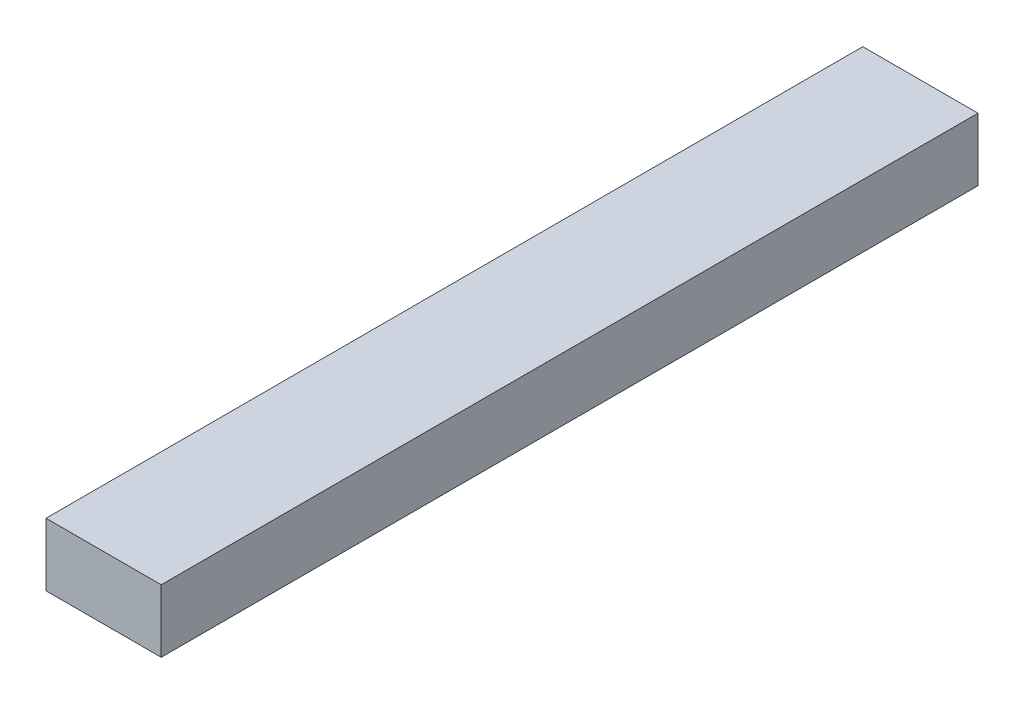
ISO-10303-21;
HEADER;
FILE_DESCRIPTION(('STEP AP214'),'2;1');
FILE_NAME('part.step','',(''),(''),'','','');
FILE_SCHEMA(('AUTOMOTIVE_DESIGN { 1 0 10303 214 1 1 1 1 }'));
ENDSEC;
DATA;
#1=APPLICATION_CONTEXT('core data for automotive mechanical design processes');
#2=APPLICATION_PROTOCOL_DEFINITION('international standard','automotive_design',2000,#1);
#3=PRODUCT_CONTEXT('',#1,'mechanical');
#4=PRODUCT('Part','Part','',(#3));
#5=PRODUCT_RELATED_PRODUCT_CATEGORY('part','',(#4));
#6=PRODUCT_DEFINITION_FORMATION('','',#4);
#7=PRODUCT_DEFINITION_CONTEXT('part definition',#1,'design');
#8=PRODUCT_DEFINITION('design','',#6,#7);
#9=PRODUCT_DEFINITION_SHAPE('','',#8);
#10=(LENGTH_UNIT() NAMED_UNIT(*) SI_UNIT(.MILLI.,.METRE.));
#11=(NAMED_UNIT(*) PLANE_ANGLE_UNIT() SI_UNIT($,.RADIAN.));
#12=(NAMED_UNIT(*) SI_UNIT($,.STERADIAN.) SOLID_ANGLE_UNIT());
#13=UNCERTAINTY_MEASURE_WITH_UNIT(LENGTH_MEASURE(1.E-05),#10,'distance_accuracy_value','');
#14=(GEOMETRIC_REPRESENTATION_CONTEXT(3) GLOBAL_UNCERTAINTY_ASSIGNED_CONTEXT((#13)) GLOBAL_UNIT_ASSIGNED_CONTEXT((#10,
#11,#12)) REPRESENTATION_CONTEXT('',''));
#15=CARTESIAN_POINT('',(0.,0.,0.));
#16=DIRECTION('',(0.,0.,1.));
#17=DIRECTION('',(1.,0.,0.));
#18=AXIS2_PLACEMENT_3D('',#15,#16,#17);
#19=CARTESIAN_POINT('',(0.,30.,0.));
#20=DIRECTION('',(1.,0.,0.));
#21=DIRECTION('',(0.,0.,-1.));
#22=AXIS2_PLACEMENT_3D('',#19,#20,#21);
#23=PLANE('',#22);
#24=DIRECTION('',(0.,0.,1.));
#25=VECTOR('',#24,1.);
#26=CARTESIAN_POINT('',(0.,0.,0.));
#27=LINE('',#26,#25);
#28=CARTESIAN_POINT('',(0.,0.,-390.));
#29=VERTEX_POINT('',#28);
#30=CARTESIAN_POINT('',(0.,0.,0.));
#31=VERTEX_POINT('',#30);
#32=EDGE_CURVE('E95',#29,#31,#27,.T.);
#33=ORIENTED_EDGE('',*,*,#32,.T.);
#34=DIRECTION('',(0.,-1.,0.));
#35=VECTOR('',#34,1.);
#36=CARTESIAN_POINT('',(0.,30.,0.));
#37=LINE('',#36,#35);
#38=CARTESIAN_POINT('',(0.,30.,0.));
#39=VERTEX_POINT('',#38);
#40=EDGE_CURVE('E11',#39,#31,#37,.T.);
#41=ORIENTED_EDGE('',*,*,#40,.F.);
#42=DIRECTION('',(0.,0.,1.));
#43=VECTOR('',#42,1.);
#44=CARTESIAN_POINT('',(0.,30.,0.));
#45=LINE('',#44,#43);
#46=CARTESIAN_POINT('',(0.,30.,-390.));
#47=VERTEX_POINT('',#46);
#48=EDGE_CURVE('E83',#47,#39,#45,.T.);
#49=ORIENTED_EDGE('',*,*,#48,.F.);
#50=DIRECTION('',(0.,-1.,0.));
#51=VECTOR('',#50,1.);
#52=CARTESIAN_POINT('',(0.,30.,-390.));
#53=LINE('',#52,#51);
#54=EDGE_CURVE('E91',#47,#29,#53,.T.);
#55=ORIENTED_EDGE('',*,*,#54,.T.);
#56=EDGE_LOOP('',(#33,#41,#49,#55));
#57=FACE_BOUND('',#56,.T.);
#58=ADVANCED_FACE('F32',(#57),#23,.F.);
#59=CARTESIAN_POINT('',(0.,30.,0.));
#60=DIRECTION('',(0.,0.,-1.));
#61=DIRECTION('',(-1.,0.,0.));
#62=AXIS2_PLACEMENT_3D('',#59,#60,#61);
#63=PLANE('',#62);
#64=DIRECTION('',(1.,0.,0.));
#65=VECTOR('',#64,1.);
#66=CARTESIAN_POINT('',(0.,0.,0.));
#67=LINE('',#66,#65);
#68=CARTESIAN_POINT('',(55.0000000000002,0.,0.));
#69=VERTEX_POINT('',#68);
#70=EDGE_CURVE('E87',#31,#69,#67,.T.);
#71=ORIENTED_EDGE('',*,*,#70,.T.);
#72=DIRECTION('',(0.,-1.,0.));
#73=VECTOR('',#72,1.);
#74=CARTESIAN_POINT('',(55.0000000000002,30.,0.));
#75=LINE('',#74,#73);
#76=CARTESIAN_POINT('',(55.0000000000002,30.,0.));
#77=VERTEX_POINT('',#76);
#78=EDGE_CURVE('E40',#77,#69,#75,.T.);
#79=ORIENTED_EDGE('',*,*,#78,.F.);
#80=DIRECTION('',(1.,0.,0.));
#81=VECTOR('',#80,1.);
#82=CARTESIAN_POINT('',(0.,30.,0.));
#83=LINE('',#82,#81);
#84=EDGE_CURVE('E78',#39,#77,#83,.T.);
#85=ORIENTED_EDGE('',*,*,#84,.F.);
#86=ORIENTED_EDGE('',*,*,#40,.T.);
#87=EDGE_LOOP('',(#71,#79,#85,#86));
#88=FACE_BOUND('',#87,.T.);
#89=ADVANCED_FACE('F86',(#88),#63,.F.);
#90=CARTESIAN_POINT('',(55.0000000000002,30.,0.));
#91=DIRECTION('',(-1.,0.,0.));
#92=DIRECTION('',(0.,0.,1.));
#93=AXIS2_PLACEMENT_3D('',#90,#91,#92);
#94=PLANE('',#93);
#95=DIRECTION('',(0.,0.,-1.));
#96=VECTOR('',#95,1.);
#97=CARTESIAN_POINT('',(55.0000000000002,0.,0.));
#98=LINE('',#97,#96);
#99=CARTESIAN_POINT('',(55.0000000000002,0.,-390.));
#100=VERTEX_POINT('',#99);
#101=EDGE_CURVE('E65',#69,#100,#98,.T.);
#102=ORIENTED_EDGE('',*,*,#101,.T.);
#103=DIRECTION('',(0.,-1.,0.));
#104=VECTOR('',#103,1.);
#105=CARTESIAN_POINT('',(55.0000000000002,30.,-390.));
#106=LINE('',#105,#104);
#107=CARTESIAN_POINT('',(55.0000000000002,30.,-390.));
#108=VERTEX_POINT('',#107);
#109=EDGE_CURVE('E88',#108,#100,#106,.T.);
#110=ORIENTED_EDGE('',*,*,#109,.F.);
#111=DIRECTION('',(0.,0.,-1.));
#112=VECTOR('',#111,1.);
#113=CARTESIAN_POINT('',(55.0000000000002,30.,0.));
#114=LINE('',#113,#112);
#115=EDGE_CURVE('E81',#77,#108,#114,.T.);
#116=ORIENTED_EDGE('',*,*,#115,.F.);
#117=ORIENTED_EDGE('',*,*,#78,.T.);
#118=EDGE_LOOP('',(#102,#110,#116,#117));
#119=FACE_BOUND('',#118,.T.);
#120=ADVANCED_FACE('F89',(#119),#94,.F.);
#121=CARTESIAN_POINT('',(0.,30.,-390.));
#122=DIRECTION('',(0.,0.,1.));
#123=DIRECTION('',(1.,0.,0.));
#124=AXIS2_PLACEMENT_3D('',#121,#122,#123);
#125=PLANE('',#124);
#126=DIRECTION('',(-1.,0.,0.));
#127=VECTOR('',#126,1.);
#128=CARTESIAN_POINT('',(0.,0.,-390.));
#129=LINE('',#128,#127);
#130=EDGE_CURVE('E71',#100,#29,#129,.T.);
#131=ORIENTED_EDGE('',*,*,#130,.T.);
#132=ORIENTED_EDGE('',*,*,#54,.F.);
#133=DIRECTION('',(-1.,0.,0.));
#134=VECTOR('',#133,1.);
#135=CARTESIAN_POINT('',(0.,30.,-390.));
#136=LINE('',#135,#134);
#137=EDGE_CURVE('E48',#108,#47,#136,.T.);
#138=ORIENTED_EDGE('',*,*,#137,.F.);
#139=ORIENTED_EDGE('',*,*,#109,.T.);
#140=EDGE_LOOP('',(#131,#132,#138,#139));
#141=FACE_BOUND('',#140,.T.);
#142=ADVANCED_FACE('F102',(#141),#125,.F.);
#143=CARTESIAN_POINT('',(0.,30.,0.));
#144=DIRECTION('',(0.,-1.,0.));
#145=DIRECTION('',(0.,0.,-1.));
#146=AXIS2_PLACEMENT_3D('',#143,#144,#145);
#147=PLANE('',#146);
#148=ORIENTED_EDGE('',*,*,#48,.T.);
#149=ORIENTED_EDGE('',*,*,#84,.T.);
#150=ORIENTED_EDGE('',*,*,#115,.T.);
#151=ORIENTED_EDGE('',*,*,#137,.T.);
#152=EDGE_LOOP('',(#148,#149,#150,#151));
#153=FACE_BOUND('',#152,.T.);
#154=ADVANCED_FACE('F79',(#153),#147,.F.);
#155=CARTESIAN_POINT('',(0.,0.,0.));
#156=DIRECTION('',(0.,-1.,0.));
#157=DIRECTION('',(0.,0.,-1.));
#158=AXIS2_PLACEMENT_3D('',#155,#156,#157);
#159=PLANE('',#158);
#160=ORIENTED_EDGE('',*,*,#32,.F.);
#161=ORIENTED_EDGE('',*,*,#130,.F.);
#162=ORIENTED_EDGE('',*,*,#101,.F.);
#163=ORIENTED_EDGE('',*,*,#70,.F.);
#164=EDGE_LOOP('',(#160,#161,#162,#163));
#165=FACE_BOUND('',#164,.T.);
#166=ADVANCED_FACE('F105',(#165),#159,.T.);
#167=CLOSED_SHELL('',(#58,#89,#120,#142,#154,#166));
#168=MANIFOLD_SOLID_BREP('B2',#167);
#169=ADVANCED_BREP_SHAPE_REPRESENTATION('',(#18,#168),#14);
#170=SHAPE_DEFINITION_REPRESENTATION(#9,#169);
ENDSEC;
END-ISO-10303-21;
